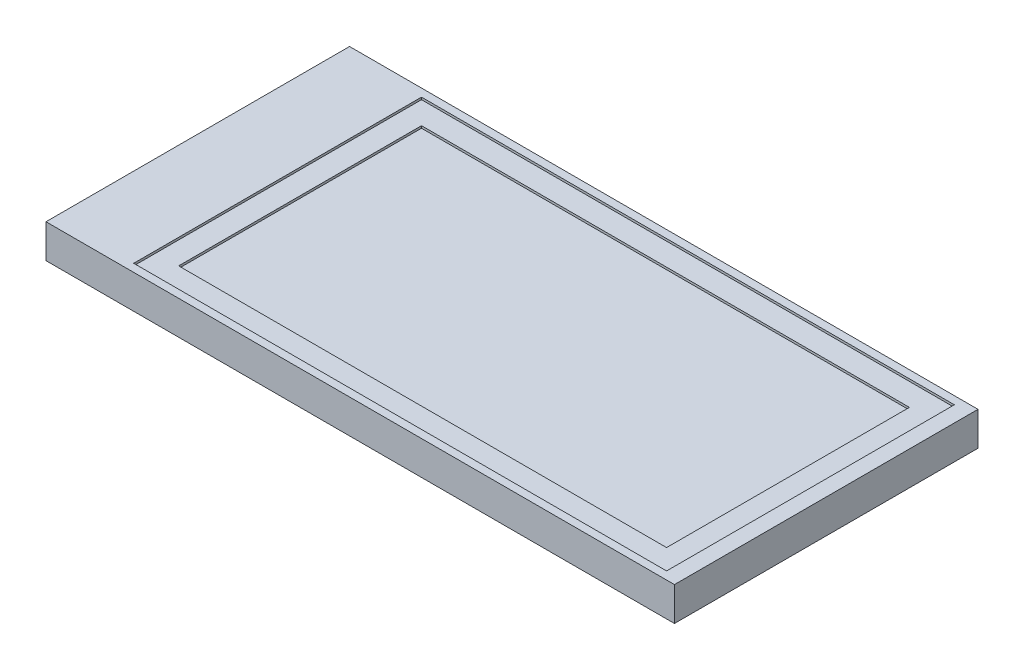
ISO-10303-21;
HEADER;
FILE_DESCRIPTION(('STEP AP214'),'2;1');
FILE_NAME('part.step','',(''),(''),'','','');
FILE_SCHEMA(('AUTOMOTIVE_DESIGN { 1 0 10303 214 1 1 1 1 }'));
ENDSEC;
DATA;
#1=APPLICATION_CONTEXT('core data for automotive mechanical design processes');
#2=APPLICATION_PROTOCOL_DEFINITION('international standard','automotive_design',2000,#1);
#3=PRODUCT_CONTEXT('',#1,'mechanical');
#4=PRODUCT('Part','Part','',(#3));
#5=PRODUCT_RELATED_PRODUCT_CATEGORY('part','',(#4));
#6=PRODUCT_DEFINITION_FORMATION('','',#4);
#7=PRODUCT_DEFINITION_CONTEXT('part definition',#1,'design');
#8=PRODUCT_DEFINITION('design','',#6,#7);
#9=PRODUCT_DEFINITION_SHAPE('','',#8);
#10=(LENGTH_UNIT() NAMED_UNIT(*) SI_UNIT(.MILLI.,.METRE.));
#11=(NAMED_UNIT(*) PLANE_ANGLE_UNIT() SI_UNIT($,.RADIAN.));
#12=(NAMED_UNIT(*) SI_UNIT($,.STERADIAN.) SOLID_ANGLE_UNIT());
#13=UNCERTAINTY_MEASURE_WITH_UNIT(LENGTH_MEASURE(1.E-05),#10,'distance_accuracy_value','');
#14=(GEOMETRIC_REPRESENTATION_CONTEXT(3) GLOBAL_UNCERTAINTY_ASSIGNED_CONTEXT((#13)) GLOBAL_UNIT_ASSIGNED_CONTEXT((#10,
#11,#12)) REPRESENTATION_CONTEXT('',''));
#15=CARTESIAN_POINT('',(0.,0.,0.));
#16=DIRECTION('',(0.,0.,1.));
#17=DIRECTION('',(1.,0.,0.));
#18=AXIS2_PLACEMENT_3D('',#15,#16,#17);
#19=CARTESIAN_POINT('',(12.55,1.5,6.75));
#20=DIRECTION('',(-1.,0.,0.));
#21=DIRECTION('',(0.,0.,1.));
#22=AXIS2_PLACEMENT_3D('',#19,#20,#21);
#23=PLANE('',#22);
#24=DIRECTION('',(0.,0.,-1.));
#25=VECTOR('',#24,1.);
#26=CARTESIAN_POINT('',(12.55,0.,6.75));
#27=LINE('',#26,#25);
#28=CARTESIAN_POINT('',(12.55,0.,6.75));
#29=VERTEX_POINT('',#28);
#30=CARTESIAN_POINT('',(12.55,0.,-6.75));
#31=VERTEX_POINT('',#30);
#32=EDGE_CURVE('E186',#29,#31,#27,.T.);
#33=ORIENTED_EDGE('',*,*,#32,.T.);
#34=DIRECTION('',(0.,-1.,0.));
#35=VECTOR('',#34,1.);
#36=CARTESIAN_POINT('',(12.55,1.5,-6.75));
#37=LINE('',#36,#35);
#38=CARTESIAN_POINT('',(12.55,1.5,-6.75));
#39=VERTEX_POINT('',#38);
#40=EDGE_CURVE('E45',#39,#31,#37,.T.);
#41=ORIENTED_EDGE('',*,*,#40,.F.);
#42=DIRECTION('',(0.,0.,-1.));
#43=VECTOR('',#42,1.);
#44=CARTESIAN_POINT('',(12.55,1.5,6.75));
#45=LINE('',#44,#43);
#46=CARTESIAN_POINT('',(12.55,1.5,6.75));
#47=VERTEX_POINT('',#46);
#48=EDGE_CURVE('E195',#47,#39,#45,.T.);
#49=ORIENTED_EDGE('',*,*,#48,.F.);
#50=DIRECTION('',(0.,-1.,0.));
#51=VECTOR('',#50,1.);
#52=CARTESIAN_POINT('',(12.55,1.5,6.75));
#53=LINE('',#52,#51);
#54=EDGE_CURVE('E205',#47,#29,#53,.T.);
#55=ORIENTED_EDGE('',*,*,#54,.T.);
#56=EDGE_LOOP('',(#33,#41,#49,#55));
#57=FACE_BOUND('',#56,.T.);
#58=ADVANCED_FACE('F38',(#57),#23,.F.);
#59=CARTESIAN_POINT('',(12.55,1.5,-6.75));
#60=DIRECTION('',(0.,0.,1.));
#61=DIRECTION('',(1.,0.,0.));
#62=AXIS2_PLACEMENT_3D('',#59,#60,#61);
#63=PLANE('',#62);
#64=DIRECTION('',(-1.,0.,0.));
#65=VECTOR('',#64,1.);
#66=CARTESIAN_POINT('',(12.55,0.,-6.75));
#67=LINE('',#66,#65);
#68=CARTESIAN_POINT('',(-15.4,0.,-6.74999999999999));
#69=VERTEX_POINT('',#68);
#70=EDGE_CURVE('E208',#31,#69,#67,.T.);
#71=ORIENTED_EDGE('',*,*,#70,.T.);
#72=DIRECTION('',(0.,-1.,0.));
#73=VECTOR('',#72,1.);
#74=CARTESIAN_POINT('',(-15.4,1.5,-6.74999999999999));
#75=LINE('',#74,#73);
#76=CARTESIAN_POINT('',(-15.4,1.5,-6.74999999999999));
#77=VERTEX_POINT('',#76);
#78=EDGE_CURVE('E218',#77,#69,#75,.T.);
#79=ORIENTED_EDGE('',*,*,#78,.F.);
#80=DIRECTION('',(-1.,0.,0.));
#81=VECTOR('',#80,1.);
#82=CARTESIAN_POINT('',(12.55,1.5,-6.75));
#83=LINE('',#82,#81);
#84=EDGE_CURVE('E198',#39,#77,#83,.T.);
#85=ORIENTED_EDGE('',*,*,#84,.F.);
#86=ORIENTED_EDGE('',*,*,#40,.T.);
#87=EDGE_LOOP('',(#71,#79,#85,#86));
#88=FACE_BOUND('',#87,.T.);
#89=ADVANCED_FACE('F223',(#88),#63,.F.);
#90=CARTESIAN_POINT('',(-15.4,1.5,6.75));
#91=DIRECTION('',(1.,0.,0.));
#92=DIRECTION('',(0.,0.,-1.));
#93=AXIS2_PLACEMENT_3D('',#90,#91,#92);
#94=PLANE('',#93);
#95=DIRECTION('',(0.,0.,1.));
#96=VECTOR('',#95,1.);
#97=CARTESIAN_POINT('',(-15.4,0.,6.75));
#98=LINE('',#97,#96);
#99=CARTESIAN_POINT('',(-15.4,0.,6.75));
#100=VERTEX_POINT('',#99);
#101=EDGE_CURVE('E210',#69,#100,#98,.T.);
#102=ORIENTED_EDGE('',*,*,#101,.T.);
#103=DIRECTION('',(0.,-1.,0.));
#104=VECTOR('',#103,1.);
#105=CARTESIAN_POINT('',(-15.4,1.5,6.75));
#106=LINE('',#105,#104);
#107=CARTESIAN_POINT('',(-15.4,1.5,6.75));
#108=VERTEX_POINT('',#107);
#109=EDGE_CURVE('E215',#108,#100,#106,.T.);
#110=ORIENTED_EDGE('',*,*,#109,.F.);
#111=DIRECTION('',(0.,0.,1.));
#112=VECTOR('',#111,1.);
#113=CARTESIAN_POINT('',(-15.4,1.5,6.75));
#114=LINE('',#113,#112);
#115=EDGE_CURVE('E201',#77,#108,#114,.T.);
#116=ORIENTED_EDGE('',*,*,#115,.F.);
#117=ORIENTED_EDGE('',*,*,#78,.T.);
#118=EDGE_LOOP('',(#102,#110,#116,#117));
#119=FACE_BOUND('',#118,.T.);
#120=ADVANCED_FACE('F235',(#119),#94,.F.);
#121=CARTESIAN_POINT('',(12.55,1.5,6.75));
#122=DIRECTION('',(0.,0.,-1.));
#123=DIRECTION('',(-1.,0.,0.));
#124=AXIS2_PLACEMENT_3D('',#121,#122,#123);
#125=PLANE('',#124);
#126=DIRECTION('',(1.,0.,0.));
#127=VECTOR('',#126,1.);
#128=CARTESIAN_POINT('',(12.55,0.,6.75));
#129=LINE('',#128,#127);
#130=EDGE_CURVE('E199',#100,#29,#129,.T.);
#131=ORIENTED_EDGE('',*,*,#130,.T.);
#132=ORIENTED_EDGE('',*,*,#54,.F.);
#133=DIRECTION('',(1.,0.,0.));
#134=VECTOR('',#133,1.);
#135=CARTESIAN_POINT('',(12.55,1.5,6.75));
#136=LINE('',#135,#134);
#137=EDGE_CURVE('E203',#108,#47,#136,.T.);
#138=ORIENTED_EDGE('',*,*,#137,.F.);
#139=ORIENTED_EDGE('',*,*,#109,.T.);
#140=EDGE_LOOP('',(#131,#132,#138,#139));
#141=FACE_BOUND('',#140,.T.);
#142=ADVANCED_FACE('F239',(#141),#125,.F.);
#143=CARTESIAN_POINT('',(0.,1.5,0.));
#144=DIRECTION('',(0.,1.,0.));
#145=DIRECTION('',(0.,0.,1.));
#146=AXIS2_PLACEMENT_3D('',#143,#144,#145);
#147=PLANE('',#146);
#148=DIRECTION('',(0.,0.,-1.));
#149=VECTOR('',#148,1.);
#150=CARTESIAN_POINT('',(11.85,1.5,6.4));
#151=LINE('',#150,#149);
#152=CARTESIAN_POINT('',(11.85,1.5,6.4));
#153=VERTEX_POINT('',#152);
#154=CARTESIAN_POINT('',(11.85,1.5,-6.4));
#155=VERTEX_POINT('',#154);
#156=EDGE_CURVE('E52',#153,#155,#151,.T.);
#157=ORIENTED_EDGE('',*,*,#156,.F.);
#158=DIRECTION('',(1.,0.,0.));
#159=VECTOR('',#158,1.);
#160=CARTESIAN_POINT('',(-11.85,1.5,6.4));
#161=LINE('',#160,#159);
#162=CARTESIAN_POINT('',(-11.85,1.5,6.4));
#163=VERTEX_POINT('',#162);
#164=EDGE_CURVE('E145',#163,#153,#161,.T.);
#165=ORIENTED_EDGE('',*,*,#164,.F.);
#166=DIRECTION('',(0.,0.,1.));
#167=VECTOR('',#166,1.);
#168=CARTESIAN_POINT('',(-11.85,1.5,6.4));
#169=LINE('',#168,#167);
#170=CARTESIAN_POINT('',(-11.85,1.5,-6.4));
#171=VERTEX_POINT('',#170);
#172=EDGE_CURVE('E148',#171,#163,#169,.T.);
#173=ORIENTED_EDGE('',*,*,#172,.F.);
#174=DIRECTION('',(-1.,0.,0.));
#175=VECTOR('',#174,1.);
#176=CARTESIAN_POINT('',(-11.85,1.5,-6.4));
#177=LINE('',#176,#175);
#178=EDGE_CURVE('E154',#155,#171,#177,.T.);
#179=ORIENTED_EDGE('',*,*,#178,.F.);
#180=EDGE_LOOP('',(#157,#165,#173,#179));
#181=FACE_BOUND('',#180,.T.);
#182=ORIENTED_EDGE('',*,*,#48,.T.);
#183=ORIENTED_EDGE('',*,*,#84,.T.);
#184=ORIENTED_EDGE('',*,*,#115,.T.);
#185=ORIENTED_EDGE('',*,*,#137,.T.);
#186=EDGE_LOOP('',(#182,#183,#184,#185));
#187=FACE_BOUND('',#186,.T.);
#188=ADVANCED_FACE('F241',(#181,#187),#147,.T.);
#189=CARTESIAN_POINT('',(0.,0.,0.));
#190=DIRECTION('',(0.,1.,0.));
#191=DIRECTION('',(0.,0.,1.));
#192=AXIS2_PLACEMENT_3D('',#189,#190,#191);
#193=PLANE('',#192);
#194=ORIENTED_EDGE('',*,*,#32,.F.);
#195=ORIENTED_EDGE('',*,*,#130,.F.);
#196=ORIENTED_EDGE('',*,*,#101,.F.);
#197=ORIENTED_EDGE('',*,*,#70,.F.);
#198=EDGE_LOOP('',(#194,#195,#196,#197));
#199=FACE_BOUND('',#198,.T.);
#200=ADVANCED_FACE('F231',(#199),#193,.F.);
#201=CARTESIAN_POINT('',(0.,1.4,0.));
#202=DIRECTION('',(0.,-1.,0.));
#203=DIRECTION('',(0.,0.,-1.));
#204=AXIS2_PLACEMENT_3D('',#201,#202,#203);
#205=PLANE('',#204);
#206=DIRECTION('',(0.,0.,-1.));
#207=VECTOR('',#206,1.);
#208=CARTESIAN_POINT('',(11.85,1.4,6.4));
#209=LINE('',#208,#207);
#210=CARTESIAN_POINT('',(11.85,1.4,6.4));
#211=VERTEX_POINT('',#210);
#212=CARTESIAN_POINT('',(11.85,1.4,-6.4));
#213=VERTEX_POINT('',#212);
#214=EDGE_CURVE('E127',#211,#213,#209,.T.);
#215=ORIENTED_EDGE('',*,*,#214,.T.);
#216=DIRECTION('',(-1.,0.,0.));
#217=VECTOR('',#216,1.);
#218=CARTESIAN_POINT('',(-11.85,1.4,-6.4));
#219=LINE('',#218,#217);
#220=CARTESIAN_POINT('',(-11.85,1.4,-6.4));
#221=VERTEX_POINT('',#220);
#222=EDGE_CURVE('E136',#213,#221,#219,.T.);
#223=ORIENTED_EDGE('',*,*,#222,.T.);
#224=DIRECTION('',(0.,0.,1.));
#225=VECTOR('',#224,1.);
#226=CARTESIAN_POINT('',(-11.85,1.4,6.4));
#227=LINE('',#226,#225);
#228=CARTESIAN_POINT('',(-11.85,1.4,6.4));
#229=VERTEX_POINT('',#228);
#230=EDGE_CURVE('E141',#221,#229,#227,.T.);
#231=ORIENTED_EDGE('',*,*,#230,.T.);
#232=DIRECTION('',(1.,0.,0.));
#233=VECTOR('',#232,1.);
#234=CARTESIAN_POINT('',(-11.85,1.4,6.4));
#235=LINE('',#234,#233);
#236=EDGE_CURVE('E133',#229,#211,#235,.T.);
#237=ORIENTED_EDGE('',*,*,#236,.T.);
#238=EDGE_LOOP('',(#215,#223,#231,#237));
#239=FACE_BOUND('',#238,.T.);
#240=DIRECTION('',(1.,0.,0.));
#241=VECTOR('',#240,1.);
#242=CARTESIAN_POINT('',(-10.85,1.4,5.4));
#243=LINE('',#242,#241);
#244=CARTESIAN_POINT('',(-10.85,1.4,5.4));
#245=VERTEX_POINT('',#244);
#246=CARTESIAN_POINT('',(10.85,1.4,5.4));
#247=VERTEX_POINT('',#246);
#248=EDGE_CURVE('E164',#245,#247,#243,.T.);
#249=ORIENTED_EDGE('',*,*,#248,.F.);
#250=DIRECTION('',(0.,0.,1.));
#251=VECTOR('',#250,1.);
#252=CARTESIAN_POINT('',(-10.85,1.4,5.4));
#253=LINE('',#252,#251);
#254=CARTESIAN_POINT('',(-10.85,1.4,-5.4));
#255=VERTEX_POINT('',#254);
#256=EDGE_CURVE('E60',#255,#245,#253,.T.);
#257=ORIENTED_EDGE('',*,*,#256,.F.);
#258=DIRECTION('',(-1.,0.,0.));
#259=VECTOR('',#258,1.);
#260=CARTESIAN_POINT('',(-10.85,1.4,-5.4));
#261=LINE('',#260,#259);
#262=CARTESIAN_POINT('',(10.85,1.4,-5.4));
#263=VERTEX_POINT('',#262);
#264=EDGE_CURVE('E11',#263,#255,#261,.T.);
#265=ORIENTED_EDGE('',*,*,#264,.F.);
#266=DIRECTION('',(0.,0.,-1.));
#267=VECTOR('',#266,1.);
#268=CARTESIAN_POINT('',(10.85,1.4,5.4));
#269=LINE('',#268,#267);
#270=EDGE_CURVE('E167',#247,#263,#269,.T.);
#271=ORIENTED_EDGE('',*,*,#270,.F.);
#272=EDGE_LOOP('',(#249,#257,#265,#271));
#273=FACE_BOUND('',#272,.T.);
#274=ADVANCED_FACE('F143',(#239,#273),#205,.F.);
#275=CARTESIAN_POINT('',(11.85,1.4,6.4));
#276=DIRECTION('',(1.,0.,0.));
#277=DIRECTION('',(0.,0.,-1.));
#278=AXIS2_PLACEMENT_3D('',#275,#276,#277);
#279=PLANE('',#278);
#280=ORIENTED_EDGE('',*,*,#156,.T.);
#281=DIRECTION('',(0.,1.,0.));
#282=VECTOR('',#281,1.);
#283=CARTESIAN_POINT('',(11.85,1.4,-6.4));
#284=LINE('',#283,#282);
#285=EDGE_CURVE('E123',#213,#155,#284,.T.);
#286=ORIENTED_EDGE('',*,*,#285,.F.);
#287=ORIENTED_EDGE('',*,*,#214,.F.);
#288=DIRECTION('',(0.,1.,0.));
#289=VECTOR('',#288,1.);
#290=CARTESIAN_POINT('',(11.85,1.4,6.4));
#291=LINE('',#290,#289);
#292=EDGE_CURVE('E158',#211,#153,#291,.T.);
#293=ORIENTED_EDGE('',*,*,#292,.T.);
#294=EDGE_LOOP('',(#280,#286,#287,#293));
#295=FACE_BOUND('',#294,.T.);
#296=ADVANCED_FACE('F125',(#295),#279,.F.);
#297=CARTESIAN_POINT('',(-11.85,1.4,6.4));
#298=DIRECTION('',(0.,0.,1.));
#299=DIRECTION('',(1.,0.,0.));
#300=AXIS2_PLACEMENT_3D('',#297,#298,#299);
#301=PLANE('',#300);
#302=ORIENTED_EDGE('',*,*,#164,.T.);
#303=ORIENTED_EDGE('',*,*,#292,.F.);
#304=ORIENTED_EDGE('',*,*,#236,.F.);
#305=DIRECTION('',(0.,1.,0.));
#306=VECTOR('',#305,1.);
#307=CARTESIAN_POINT('',(-11.85,1.4,6.4));
#308=LINE('',#307,#306);
#309=EDGE_CURVE('E160',#229,#163,#308,.T.);
#310=ORIENTED_EDGE('',*,*,#309,.T.);
#311=EDGE_LOOP('',(#302,#303,#304,#310));
#312=FACE_BOUND('',#311,.T.);
#313=ADVANCED_FACE('F308',(#312),#301,.F.);
#314=CARTESIAN_POINT('',(-11.85,1.4,6.4));
#315=DIRECTION('',(-1.,0.,0.));
#316=DIRECTION('',(0.,0.,1.));
#317=AXIS2_PLACEMENT_3D('',#314,#315,#316);
#318=PLANE('',#317);
#319=ORIENTED_EDGE('',*,*,#172,.T.);
#320=ORIENTED_EDGE('',*,*,#309,.F.);
#321=ORIENTED_EDGE('',*,*,#230,.F.);
#322=DIRECTION('',(0.,1.,0.));
#323=VECTOR('',#322,1.);
#324=CARTESIAN_POINT('',(-11.85,1.4,-6.4));
#325=LINE('',#324,#323);
#326=EDGE_CURVE('E132',#221,#171,#325,.T.);
#327=ORIENTED_EDGE('',*,*,#326,.T.);
#328=EDGE_LOOP('',(#319,#320,#321,#327));
#329=FACE_BOUND('',#328,.T.);
#330=ADVANCED_FACE('F317',(#329),#318,.F.);
#331=CARTESIAN_POINT('',(-11.85,1.4,-6.4));
#332=DIRECTION('',(0.,0.,-1.));
#333=DIRECTION('',(-1.,0.,0.));
#334=AXIS2_PLACEMENT_3D('',#331,#332,#333);
#335=PLANE('',#334);
#336=ORIENTED_EDGE('',*,*,#178,.T.);
#337=ORIENTED_EDGE('',*,*,#326,.F.);
#338=ORIENTED_EDGE('',*,*,#222,.F.);
#339=ORIENTED_EDGE('',*,*,#285,.T.);
#340=EDGE_LOOP('',(#336,#337,#338,#339));
#341=FACE_BOUND('',#340,.T.);
#342=ADVANCED_FACE('F137',(#341),#335,.F.);
#343=CARTESIAN_POINT('',(0.,1.3,0.));
#344=DIRECTION('',(0.,-1.,0.));
#345=DIRECTION('',(0.,0.,-1.));
#346=AXIS2_PLACEMENT_3D('',#343,#344,#345);
#347=PLANE('',#346);
#348=DIRECTION('',(0.,0.,-1.));
#349=VECTOR('',#348,1.);
#350=CARTESIAN_POINT('',(10.85,1.3,5.4));
#351=LINE('',#350,#349);
#352=CARTESIAN_POINT('',(10.85,1.3,5.4));
#353=VERTEX_POINT('',#352);
#354=CARTESIAN_POINT('',(10.85,1.3,-5.4));
#355=VERTEX_POINT('',#354);
#356=EDGE_CURVE('E170',#353,#355,#351,.T.);
#357=ORIENTED_EDGE('',*,*,#356,.T.);
#358=DIRECTION('',(-1.,0.,0.));
#359=VECTOR('',#358,1.);
#360=CARTESIAN_POINT('',(-10.85,1.3,-5.4));
#361=LINE('',#360,#359);
#362=CARTESIAN_POINT('',(-10.85,1.3,-5.4));
#363=VERTEX_POINT('',#362);
#364=EDGE_CURVE('E173',#355,#363,#361,.T.);
#365=ORIENTED_EDGE('',*,*,#364,.T.);
#366=DIRECTION('',(0.,0.,1.));
#367=VECTOR('',#366,1.);
#368=CARTESIAN_POINT('',(-10.85,1.3,5.4));
#369=LINE('',#368,#367);
#370=CARTESIAN_POINT('',(-10.85,1.3,5.4));
#371=VERTEX_POINT('',#370);
#372=EDGE_CURVE('E176',#363,#371,#369,.T.);
#373=ORIENTED_EDGE('',*,*,#372,.T.);
#374=DIRECTION('',(1.,0.,0.));
#375=VECTOR('',#374,1.);
#376=CARTESIAN_POINT('',(-10.85,1.3,5.4));
#377=LINE('',#376,#375);
#378=EDGE_CURVE('E179',#371,#353,#377,.T.);
#379=ORIENTED_EDGE('',*,*,#378,.T.);
#380=EDGE_LOOP('',(#357,#365,#373,#379));
#381=FACE_BOUND('',#380,.T.);
#382=ADVANCED_FACE('F280',(#381),#347,.F.);
#383=CARTESIAN_POINT('',(-10.85,1.3,-5.4));
#384=DIRECTION('',(0.,0.,-1.));
#385=DIRECTION('',(-1.,0.,0.));
#386=AXIS2_PLACEMENT_3D('',#383,#384,#385);
#387=PLANE('',#386);
#388=DIRECTION('',(0.,1.,0.));
#389=VECTOR('',#388,1.);
#390=CARTESIAN_POINT('',(10.85,1.3,-5.4));
#391=LINE('',#390,#389);
#392=EDGE_CURVE('E182',#355,#263,#391,.T.);
#393=ORIENTED_EDGE('',*,*,#392,.T.);
#394=ORIENTED_EDGE('',*,*,#264,.T.);
#395=DIRECTION('',(0.,1.,0.));
#396=VECTOR('',#395,1.);
#397=CARTESIAN_POINT('',(-10.85,1.3,-5.4));
#398=LINE('',#397,#396);
#399=EDGE_CURVE('E190',#363,#255,#398,.T.);
#400=ORIENTED_EDGE('',*,*,#399,.F.);
#401=ORIENTED_EDGE('',*,*,#364,.F.);
#402=EDGE_LOOP('',(#393,#394,#400,#401));
#403=FACE_BOUND('',#402,.T.);
#404=ADVANCED_FACE('F285',(#403),#387,.F.);
#405=CARTESIAN_POINT('',(-10.85,1.3,5.4));
#406=DIRECTION('',(-1.,0.,0.));
#407=DIRECTION('',(0.,0.,1.));
#408=AXIS2_PLACEMENT_3D('',#405,#406,#407);
#409=PLANE('',#408);
#410=ORIENTED_EDGE('',*,*,#399,.T.);
#411=ORIENTED_EDGE('',*,*,#256,.T.);
#412=DIRECTION('',(0.,1.,0.));
#413=VECTOR('',#412,1.);
#414=CARTESIAN_POINT('',(-10.85,1.3,5.4));
#415=LINE('',#414,#413);
#416=EDGE_CURVE('E187',#371,#245,#415,.T.);
#417=ORIENTED_EDGE('',*,*,#416,.F.);
#418=ORIENTED_EDGE('',*,*,#372,.F.);
#419=EDGE_LOOP('',(#410,#411,#417,#418));
#420=FACE_BOUND('',#419,.T.);
#421=ADVANCED_FACE('F343',(#420),#409,.F.);
#422=CARTESIAN_POINT('',(-10.85,1.3,5.4));
#423=DIRECTION('',(0.,0.,1.));
#424=DIRECTION('',(1.,0.,0.));
#425=AXIS2_PLACEMENT_3D('',#422,#423,#424);
#426=PLANE('',#425);
#427=ORIENTED_EDGE('',*,*,#416,.T.);
#428=ORIENTED_EDGE('',*,*,#248,.T.);
#429=DIRECTION('',(0.,1.,0.));
#430=VECTOR('',#429,1.);
#431=CARTESIAN_POINT('',(10.85,1.3,5.4));
#432=LINE('',#431,#430);
#433=EDGE_CURVE('E183',#353,#247,#432,.T.);
#434=ORIENTED_EDGE('',*,*,#433,.F.);
#435=ORIENTED_EDGE('',*,*,#378,.F.);
#436=EDGE_LOOP('',(#427,#428,#434,#435));
#437=FACE_BOUND('',#436,.T.);
#438=ADVANCED_FACE('F353',(#437),#426,.F.);
#439=CARTESIAN_POINT('',(10.85,1.3,5.4));
#440=DIRECTION('',(1.,0.,0.));
#441=DIRECTION('',(0.,0.,-1.));
#442=AXIS2_PLACEMENT_3D('',#439,#440,#441);
#443=PLANE('',#442);
#444=ORIENTED_EDGE('',*,*,#433,.T.);
#445=ORIENTED_EDGE('',*,*,#270,.T.);
#446=ORIENTED_EDGE('',*,*,#392,.F.);
#447=ORIENTED_EDGE('',*,*,#356,.F.);
#448=EDGE_LOOP('',(#444,#445,#446,#447));
#449=FACE_BOUND('',#448,.T.);
#450=ADVANCED_FACE('F363',(#449),#443,.F.);
#451=CLOSED_SHELL('',(#58,#89,#120,#142,#188,#200,#274,#296,#313,#330,#342,#382,#404,#421,#438,#450));
#452=MANIFOLD_SOLID_BREP('B2',#451);
#453=ADVANCED_BREP_SHAPE_REPRESENTATION('',(#18,#452),#14);
#454=SHAPE_DEFINITION_REPRESENTATION(#9,#453);
ENDSEC;
END-ISO-10303-21;
